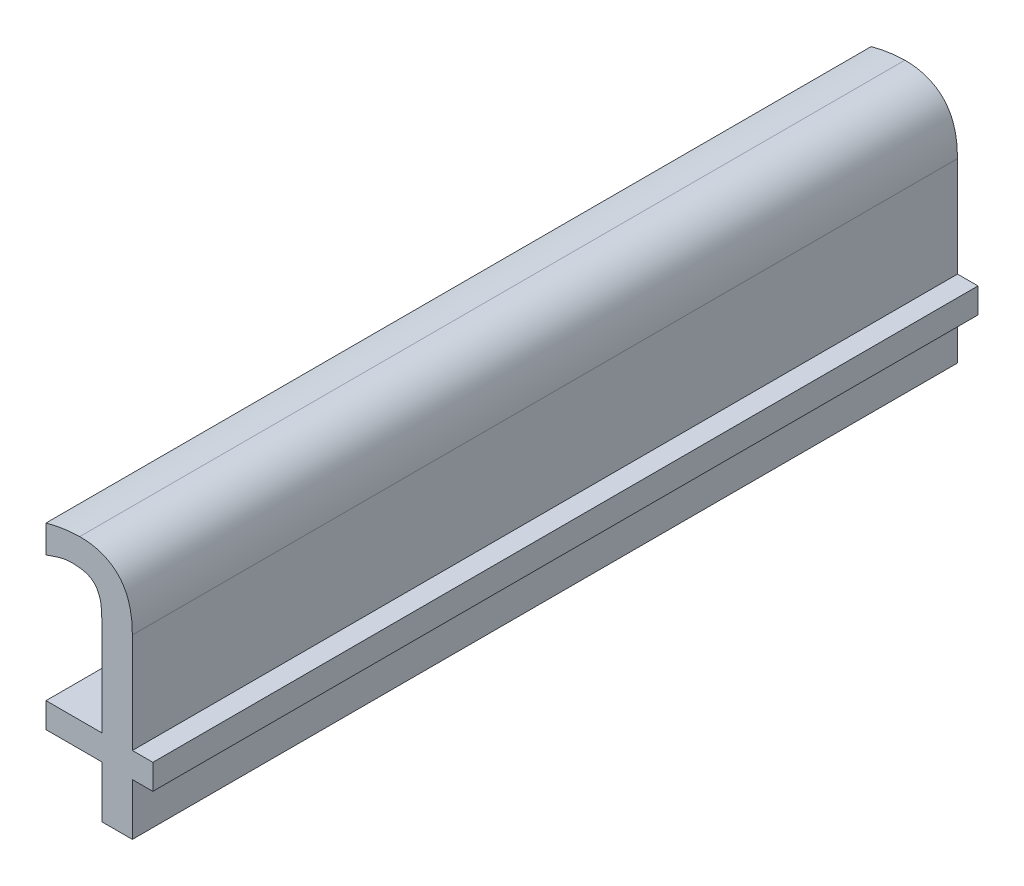
ISO-10303-21;
HEADER;
FILE_DESCRIPTION(('STEP AP214'),'2;1');
FILE_NAME('part.step','',(''),(''),'','','');
FILE_SCHEMA(('AUTOMOTIVE_DESIGN { 1 0 10303 214 1 1 1 1 }'));
ENDSEC;
DATA;
#1=APPLICATION_CONTEXT('core data for automotive mechanical design processes');
#2=APPLICATION_PROTOCOL_DEFINITION('international standard','automotive_design',2000,#1);
#3=PRODUCT_CONTEXT('',#1,'mechanical');
#4=PRODUCT('Part','Part','',(#3));
#5=PRODUCT_RELATED_PRODUCT_CATEGORY('part','',(#4));
#6=PRODUCT_DEFINITION_FORMATION('','',#4);
#7=PRODUCT_DEFINITION_CONTEXT('part definition',#1,'design');
#8=PRODUCT_DEFINITION('design','',#6,#7);
#9=PRODUCT_DEFINITION_SHAPE('','',#8);
#10=(LENGTH_UNIT() NAMED_UNIT(*) SI_UNIT(.MILLI.,.METRE.));
#11=(NAMED_UNIT(*) PLANE_ANGLE_UNIT() SI_UNIT($,.RADIAN.));
#12=(NAMED_UNIT(*) SI_UNIT($,.STERADIAN.) SOLID_ANGLE_UNIT());
#13=UNCERTAINTY_MEASURE_WITH_UNIT(LENGTH_MEASURE(1.E-05),#10,'distance_accuracy_value','');
#14=(GEOMETRIC_REPRESENTATION_CONTEXT(3) GLOBAL_UNCERTAINTY_ASSIGNED_CONTEXT((#13)) GLOBAL_UNIT_ASSIGNED_CONTEXT((#10,
#11,#12)) REPRESENTATION_CONTEXT('',''));
#15=CARTESIAN_POINT('',(0.,0.,0.));
#16=DIRECTION('',(0.,0.,1.));
#17=DIRECTION('',(1.,0.,0.));
#18=AXIS2_PLACEMENT_3D('',#15,#16,#17);
#19=CARTESIAN_POINT('',(4.99958278409742,3.57171991261153,0.));
#20=CARTESIAN_POINT('',(4.99958278409742,3.57171991261153,0.1));
#21=CARTESIAN_POINT('',(4.99976601556421,3.57180007637876,0.));
#22=CARTESIAN_POINT('',(4.99976601556421,3.57180007637876,0.1));
#23=CARTESIAN_POINT('',(4.999949247031,3.571880240146,0.));
#24=CARTESIAN_POINT('',(4.999949247031,3.571880240146,0.1));
#25=CARTESIAN_POINT('',(5.000327334592,3.572045653455,0.));
#26=CARTESIAN_POINT('',(5.000327334592,3.572045653455,0.1));
#27=CARTESIAN_POINT('',(5.002005098146,3.572589154324,0.));
#28=CARTESIAN_POINT('',(5.002005098146,3.572589154324,0.1));
#29=CARTESIAN_POINT('',(5.002903056105,3.572589154324,0.));
#30=CARTESIAN_POINT('',(5.002903056105,3.572589154324,0.1));
#31=B_SPLINE_SURFACE_WITH_KNOTS('',2,1,((#19,#20),(#21,#22),(#23,#24),(#25,#26),(#27,#28),(#29,
#30)),.UNSPECIFIED.,.F.,.F.,.F.,(3,2,1,3),(2,2),(-2.48462706973712,-2.,-1.,0.),(0.,0.01),.UNSPECIFIED.);
#32=CARTESIAN_POINT('',(4.99977074011654,3.57180214337042,0.1));
#33=CARTESIAN_POINT('',(5.00019724079842,3.57197394980934,0.1));
#34=CARTESIAN_POINT('',(5.00063255067664,3.57214782170769,0.1));
#35=CARTESIAN_POINT('',(5.00137153524604,3.57238152407649,0.1));
#36=CARTESIAN_POINT('',(5.00167007413485,3.57246003887722,0.1));
#37=CARTESIAN_POINT('',(5.00227859787437,3.57256779812837,0.1));
#38=CARTESIAN_POINT('',(5.00258867042853,3.57259651228609,0.1));
#39=CARTESIAN_POINT('',(5.002903056105,3.572589154324,0.1));
#40=B_SPLINE_CURVE_WITH_KNOTS('',3,(#32,#33,#34,#35,#36,#37,#38,#39),.UNSPECIFIED.,.F.,.F.,(4,2,
2,4),(0.,0.00139383914747323,0.00231744531135856,0.00325082728566496),.UNSPECIFIED.);
#41=CARTESIAN_POINT('',(4.99975365644677,3.57184119175821,0.1));
#42=VERTEX_POINT('',#41);
#43=CARTESIAN_POINT('',(5.002903056105,3.572589154324,0.1));
#44=VERTEX_POINT('',#43);
#45=EDGE_CURVE('E208',#42,#44,#40,.T.);
#46=DIRECTION('',(0.,0.,1.));
#47=VECTOR('',#46,1.);
#48=CARTESIAN_POINT('',(4.999736572777,3.57178719515928,0.));
#49=LINE('',#48,#47);
#50=CARTESIAN_POINT('',(4.99975365644677,3.57184119175821,0.));
#51=VERTEX_POINT('',#50);
#52=EDGE_CURVE('E146',#51,#42,#49,.T.);
#53=CARTESIAN_POINT('',(4.99977074011654,3.57180214337042,0.));
#54=CARTESIAN_POINT('',(5.00019724079843,3.57197394980934,0.));
#55=CARTESIAN_POINT('',(5.00063255067664,3.57214782170769,0.));
#56=CARTESIAN_POINT('',(5.00137153524605,3.57238152407649,0.));
#57=CARTESIAN_POINT('',(5.00167007413485,3.57246003887722,0.));
#58=CARTESIAN_POINT('',(5.00227859787438,3.57256779812837,0.));
#59=CARTESIAN_POINT('',(5.00258867042853,3.57259651228609,0.));
#60=CARTESIAN_POINT('',(5.002903056105,3.572589154324,0.));
#61=B_SPLINE_CURVE_WITH_KNOTS('',3,(#53,#54,#55,#56,#57,#58,#59,#60),.UNSPECIFIED.,.F.,.F.,(4,2,
2,4),(0.,0.00139383914747404,0.00231744531135842,0.00325082728566396),.UNSPECIFIED.);
#62=CARTESIAN_POINT('',(5.002903056105,3.572589154324,0.));
#63=VERTEX_POINT('',#62);
#64=EDGE_CURVE('E142',#51,#63,#61,.T.);
#65=DIRECTION('',(0.,0.,-1.));
#66=VECTOR('',#65,1.);
#67=CARTESIAN_POINT('',(5.002903056105,3.572589154324,0.05));
#68=LINE('',#67,#66);
#69=EDGE_CURVE('E143',#44,#63,#68,.T.);
#70=ORIENTED_EDGE('',*,*,#45,.F.);
#71=ORIENTED_EDGE('',*,*,#52,.F.);
#72=ORIENTED_EDGE('',*,*,#64,.T.);
#73=ORIENTED_EDGE('',*,*,#69,.F.);
#74=EDGE_LOOP('',(#70,#71,#72,#73));
#75=FACE_BOUND('',#74,.T.);
#76=ADVANCED_FACE('F17',(#75),#31,.T.);
#77=CARTESIAN_POINT('',(5.002903056105,3.572589154324,0.));
#78=CARTESIAN_POINT('',(5.002903056105,3.572589154324,0.1));
#79=CARTESIAN_POINT('',(5.004179101625,3.572589154324,0.));
#80=CARTESIAN_POINT('',(5.004179101625,3.572589154324,0.1));
#81=CARTESIAN_POINT('',(5.005667821398,3.571903870619,0.));
#82=CARTESIAN_POINT('',(5.005667821398,3.571903870619,0.1));
#83=CARTESIAN_POINT('',(5.005998648014,3.571218586914,0.));
#84=CARTESIAN_POINT('',(5.005998648014,3.571218586914,0.1));
#85=B_SPLINE_SURFACE_WITH_KNOTS('',2,1,((#77,#78),(#79,#80),(#81,#82),(#83,#84)),.UNSPECIFIED.,
.F.,.F.,.F.,(3,1,3),(2,2),(-2.,-1.,0.),(0.,0.01),.UNSPECIFIED.);
#86=CARTESIAN_POINT('',(5.002903056105,3.572589154324,0.1));
#87=CARTESIAN_POINT('',(5.0032338405436,3.57258669764765,0.1));
#88=CARTESIAN_POINT('',(5.00358269931623,3.57257162553546,0.1));
#89=CARTESIAN_POINT('',(5.00426705439678,3.57247347746843,0.1));
#90=CARTESIAN_POINT('',(5.00460261219088,3.57239076563957,0.1));
#91=CARTESIAN_POINT('',(5.00536060185048,3.57205022235926,0.1));
#92=CARTESIAN_POINT('',(5.00574884935335,3.57172797974789,0.1));
#93=CARTESIAN_POINT('',(5.00599864800042,3.57121858694212,0.1));
#94=B_SPLINE_CURVE_WITH_KNOTS('',3,(#86,#87,#88,#89,#90,#91,#92,#93),.UNSPECIFIED.,.F.,.F.,(4,2,
2,4),(0.,0.00102491313481117,0.00204434487850244,0.00354685890757763),.UNSPECIFIED.);
#95=CARTESIAN_POINT('',(5.005998648014,3.571218586914,0.1));
#96=VERTEX_POINT('',#95);
#97=EDGE_CURVE('E154',#44,#96,#94,.T.);
#98=CARTESIAN_POINT('',(5.002903056105,3.572589154324,0.));
#99=CARTESIAN_POINT('',(5.0032338405436,3.57258669764765,0.));
#100=CARTESIAN_POINT('',(5.00358269931623,3.57257162553546,0.));
#101=CARTESIAN_POINT('',(5.00426705439678,3.57247347746843,0.));
#102=CARTESIAN_POINT('',(5.00460261219088,3.57239076563957,0.));
#103=CARTESIAN_POINT('',(5.00536060185048,3.57205022235926,0.));
#104=CARTESIAN_POINT('',(5.00574884935335,3.57172797974789,0.));
#105=CARTESIAN_POINT('',(5.00599864800042,3.57121858694212,0.));
#106=B_SPLINE_CURVE_WITH_KNOTS('',3,(#98,#99,#100,#101,#102,#103,#104,#105),.UNSPECIFIED.,.F.,
.F.,(4,2,2,4),(0.,0.00102491313481117,0.00204434487850244,0.00354685890757912),.UNSPECIFIED.);
#107=CARTESIAN_POINT('',(5.00599864801486,3.57121858691456,0.));
#108=VERTEX_POINT('',#107);
#109=EDGE_CURVE('E137',#63,#108,#106,.T.);
#110=DIRECTION('',(0.,0.,-1.));
#111=VECTOR('',#110,1.);
#112=CARTESIAN_POINT('',(5.005998648014,3.571218586914,0.05));
#113=LINE('',#112,#111);
#114=EDGE_CURVE('E156',#96,#108,#113,.T.);
#115=ORIENTED_EDGE('',*,*,#97,.F.);
#116=ORIENTED_EDGE('',*,*,#69,.T.);
#117=ORIENTED_EDGE('',*,*,#109,.T.);
#118=ORIENTED_EDGE('',*,*,#114,.F.);
#119=EDGE_LOOP('',(#115,#116,#117,#118));
#120=FACE_BOUND('',#119,.T.);
#121=ADVANCED_FACE('F152',(#120),#85,.T.);
#122=CARTESIAN_POINT('',(5.005998648014,3.571218586914,0.));
#123=CARTESIAN_POINT('',(5.005998648014,3.571218586914,0.1));
#124=CARTESIAN_POINT('',(5.006400366048,3.570438781318,0.));
#125=CARTESIAN_POINT('',(5.006400366048,3.570438781318,0.1));
#126=CARTESIAN_POINT('',(5.006518518411,3.568619234929,0.));
#127=CARTESIAN_POINT('',(5.006518518411,3.568619234929,0.1));
#128=CARTESIAN_POINT('',(5.006518518411,3.566965101847,0.));
#129=CARTESIAN_POINT('',(5.006518518411,3.566965101847,0.1));
#130=B_SPLINE_SURFACE_WITH_KNOTS('',2,1,((#122,#123),(#124,#125),(#126,#127),(#128,#129)),
.UNSPECIFIED.,.F.,.F.,.F.,(3,1,3),(2,2),(-2.,-1.,0.),(0.,0.01),.UNSPECIFIED.);
#131=CARTESIAN_POINT('',(5.005998648014,3.571218586914,0.1));
#132=CARTESIAN_POINT('',(5.00617890398059,3.57090392574342,0.1));
#133=CARTESIAN_POINT('',(5.006289480242,3.57056949751319,0.1));
#134=CARTESIAN_POINT('',(5.00642999236957,3.5698816436223,0.1));
#135=CARTESIAN_POINT('',(5.00645991904458,3.56952821580104,0.1));
#136=CARTESIAN_POINT('',(5.0064978349018,3.56882301385988,0.1));
#137=CARTESIAN_POINT('',(5.00650582615831,3.56847123958675,0.1));
#138=CARTESIAN_POINT('',(5.0065143740803,3.56773506963006,0.1));
#139=CARTESIAN_POINT('',(5.00651417479553,3.56735066588093,0.1));
#140=CARTESIAN_POINT('',(5.006518518411,3.566965101847,0.1));
#141=B_SPLINE_CURVE_WITH_KNOTS('',3,(#131,#132,#133,#134,#135,#136,#137,#138,#139,#140),
.UNSPECIFIED.,.F.,.F.,(4,2,2,2,4),(0.,0.00105660986660643,0.00211334014378797,0.003169970489298,
0.00432432436821628),.UNSPECIFIED.);
#142=CARTESIAN_POINT('',(5.006518518411,3.566965101847,0.1));
#143=VERTEX_POINT('',#142);
#144=EDGE_CURVE('E207',#96,#143,#141,.T.);
#145=CARTESIAN_POINT('',(5.005998648014,3.571218586914,0.));
#146=CARTESIAN_POINT('',(5.00617890398059,3.57090392574342,0.));
#147=CARTESIAN_POINT('',(5.006289480242,3.57056949751319,0.));
#148=CARTESIAN_POINT('',(5.00642999236957,3.5698816436223,0.));
#149=CARTESIAN_POINT('',(5.00645991904458,3.56952821580104,0.));
#150=CARTESIAN_POINT('',(5.0064978349018,3.56882301385988,0.));
#151=CARTESIAN_POINT('',(5.00650582615831,3.56847123958675,0.));
#152=CARTESIAN_POINT('',(5.0065143740803,3.56773506963006,0.));
#153=CARTESIAN_POINT('',(5.00651417479553,3.56735066588093,0.));
#154=CARTESIAN_POINT('',(5.006518518411,3.566965101847,0.));
#155=B_SPLINE_CURVE_WITH_KNOTS('',3,(#145,#146,#147,#148,#149,#150,#151,#152,#153,#154),
.UNSPECIFIED.,.F.,.F.,(4,2,2,2,4),(0.,0.00105660986660643,0.00211334014378797,0.003169970489298,
0.00432432436821628),.UNSPECIFIED.);
#156=CARTESIAN_POINT('',(5.006518518411,3.566965101847,0.));
#157=VERTEX_POINT('',#156);
#158=EDGE_CURVE('E161',#108,#157,#155,.T.);
#159=DIRECTION('',(0.,0.,1.));
#160=VECTOR('',#159,1.);
#161=CARTESIAN_POINT('',(5.006518518411,3.566965101847,0.));
#162=LINE('',#161,#160);
#163=EDGE_CURVE('E346',#143,#157,#162,.F.);
#164=ORIENTED_EDGE('',*,*,#144,.F.);
#165=ORIENTED_EDGE('',*,*,#114,.T.);
#166=ORIENTED_EDGE('',*,*,#158,.T.);
#167=ORIENTED_EDGE('',*,*,#163,.F.);
#168=EDGE_LOOP('',(#164,#165,#166,#167));
#169=FACE_BOUND('',#168,.T.);
#170=ADVANCED_FACE('F186',(#169),#130,.T.);
#171=CARTESIAN_POINT('',(5.006518518411,3.566965101847,0.));
#172=DIRECTION('',(-1.,0.,0.));
#173=DIRECTION('',(0.,0.,1.));
#174=AXIS2_PLACEMENT_3D('',#171,#172,#173);
#175=PLANE('',#174);
#176=DIRECTION('',(0.,1.,0.));
#177=VECTOR('',#176,1.);
#178=CARTESIAN_POINT('',(5.006518518411,3.560627014666,0.1));
#179=LINE('',#178,#177);
#180=CARTESIAN_POINT('',(5.006518518411,3.556544063435,0.1));
#181=VERTEX_POINT('',#180);
#182=EDGE_CURVE('E341',#143,#181,#179,.F.);
#183=ORIENTED_EDGE('',*,*,#182,.F.);
#184=ORIENTED_EDGE('',*,*,#163,.T.);
#185=DIRECTION('',(0.,1.,0.));
#186=VECTOR('',#185,1.);
#187=CARTESIAN_POINT('',(5.006518518411,3.560627014666,0.));
#188=LINE('',#187,#186);
#189=CARTESIAN_POINT('',(5.006518518411,3.556544063435,0.));
#190=VERTEX_POINT('',#189);
#191=EDGE_CURVE('E163',#157,#190,#188,.F.);
#192=ORIENTED_EDGE('',*,*,#191,.T.);
#193=DIRECTION('',(0.,0.,1.));
#194=VECTOR('',#193,1.);
#195=CARTESIAN_POINT('',(5.006518518411,3.556544063435,0.));
#196=LINE('',#195,#194);
#197=EDGE_CURVE('E336',#181,#190,#196,.F.);
#198=ORIENTED_EDGE('',*,*,#197,.F.);
#199=EDGE_LOOP('',(#183,#184,#192,#198));
#200=FACE_BOUND('',#199,.T.);
#201=ADVANCED_FACE('F390',(#200),#175,.T.);
#202=CARTESIAN_POINT('',(5.006518518411,3.556544063435,0.));
#203=DIRECTION('',(0.,1.,0.));
#204=DIRECTION('',(0.,0.,1.));
#205=AXIS2_PLACEMENT_3D('',#202,#203,#204);
#206=PLANE('',#205);
#207=DIRECTION('',(1.,0.,0.));
#208=VECTOR('',#207,1.);
#209=CARTESIAN_POINT('',(5.006616061911,3.556544063435,0.1));
#210=LINE('',#209,#208);
#211=CARTESIAN_POINT('',(4.999736572777,3.556544063435,0.1));
#212=VERTEX_POINT('',#211);
#213=EDGE_CURVE('E331',#181,#212,#210,.F.);
#214=ORIENTED_EDGE('',*,*,#213,.F.);
#215=ORIENTED_EDGE('',*,*,#197,.T.);
#216=DIRECTION('',(1.,0.,0.));
#217=VECTOR('',#216,1.);
#218=CARTESIAN_POINT('',(5.006616061911,3.556544063435,0.));
#219=LINE('',#218,#217);
#220=CARTESIAN_POINT('',(4.999736572777,3.556544063435,0.));
#221=VERTEX_POINT('',#220);
#222=EDGE_CURVE('E381',#190,#221,#219,.F.);
#223=ORIENTED_EDGE('',*,*,#222,.T.);
#224=DIRECTION('',(0.,0.,1.));
#225=VECTOR('',#224,1.);
#226=CARTESIAN_POINT('',(4.999736572777,3.556544063435,0.));
#227=LINE('',#226,#225);
#228=EDGE_CURVE('E326',#212,#221,#227,.F.);
#229=ORIENTED_EDGE('',*,*,#228,.F.);
#230=EDGE_LOOP('',(#214,#215,#223,#229));
#231=FACE_BOUND('',#230,.T.);
#232=ADVANCED_FACE('F394',(#231),#206,.T.);
#233=CARTESIAN_POINT('',(4.999736572777,3.556544063435,0.));
#234=DIRECTION('',(-1.,0.,0.));
#235=DIRECTION('',(0.,0.,1.));
#236=AXIS2_PLACEMENT_3D('',#233,#234,#235);
#237=PLANE('',#236);
#238=DIRECTION('',(0.,1.,0.));
#239=VECTOR('',#238,1.);
#240=CARTESIAN_POINT('',(4.999736572777,3.560627014666,0.1));
#241=LINE('',#240,#239);
#242=CARTESIAN_POINT('',(4.999736572777,3.55349573247,0.1));
#243=VERTEX_POINT('',#242);
#244=EDGE_CURVE('E321',#212,#243,#241,.F.);
#245=ORIENTED_EDGE('',*,*,#244,.F.);
#246=ORIENTED_EDGE('',*,*,#228,.T.);
#247=DIRECTION('',(0.,1.,0.));
#248=VECTOR('',#247,1.);
#249=CARTESIAN_POINT('',(4.999736572777,3.560627014666,0.));
#250=LINE('',#249,#248);
#251=CARTESIAN_POINT('',(4.999736572777,3.55349573247,0.));
#252=VERTEX_POINT('',#251);
#253=EDGE_CURVE('E377',#221,#252,#250,.F.);
#254=ORIENTED_EDGE('',*,*,#253,.T.);
#255=DIRECTION('',(0.,0.,-1.));
#256=VECTOR('',#255,1.);
#257=CARTESIAN_POINT('',(4.999736572777,3.55349573247,0.));
#258=LINE('',#257,#256);
#259=EDGE_CURVE('E316',#243,#252,#258,.T.);
#260=ORIENTED_EDGE('',*,*,#259,.F.);
#261=EDGE_LOOP('',(#245,#246,#254,#260));
#262=FACE_BOUND('',#261,.T.);
#263=ADVANCED_FACE('F400',(#262),#237,.T.);
#264=CARTESIAN_POINT('',(4.999736572777,3.55349573247,0.));
#265=DIRECTION('',(0.,-1.,0.));
#266=DIRECTION('',(0.,0.,-1.));
#267=AXIS2_PLACEMENT_3D('',#264,#265,#266);
#268=PLANE('',#267);
#269=DIRECTION('',(1.,0.,0.));
#270=VECTOR('',#269,1.);
#271=CARTESIAN_POINT('',(5.006616061911,3.55349573247,0.1));
#272=LINE('',#271,#270);
#273=CARTESIAN_POINT('',(5.006518518411,3.55349573247,0.1));
#274=VERTEX_POINT('',#273);
#275=EDGE_CURVE('E311',#243,#274,#272,.T.);
#276=ORIENTED_EDGE('',*,*,#275,.F.);
#277=ORIENTED_EDGE('',*,*,#259,.T.);
#278=DIRECTION('',(1.,0.,0.));
#279=VECTOR('',#278,1.);
#280=CARTESIAN_POINT('',(5.006616061911,3.55349573247,0.));
#281=LINE('',#280,#279);
#282=CARTESIAN_POINT('',(5.006518518411,3.55349573247,0.));
#283=VERTEX_POINT('',#282);
#284=EDGE_CURVE('E373',#252,#283,#281,.T.);
#285=ORIENTED_EDGE('',*,*,#284,.T.);
#286=DIRECTION('',(0.,0.,1.));
#287=VECTOR('',#286,1.);
#288=CARTESIAN_POINT('',(5.006518518411,3.55349573247,0.));
#289=LINE('',#288,#287);
#290=EDGE_CURVE('E306',#274,#283,#289,.F.);
#291=ORIENTED_EDGE('',*,*,#290,.F.);
#292=EDGE_LOOP('',(#276,#277,#285,#291));
#293=FACE_BOUND('',#292,.T.);
#294=ADVANCED_FACE('F403',(#293),#268,.T.);
#295=CARTESIAN_POINT('',(5.006518518411,3.55349573247,0.));
#296=DIRECTION('',(-1.,0.,0.));
#297=DIRECTION('',(0.,0.,1.));
#298=AXIS2_PLACEMENT_3D('',#295,#296,#297);
#299=PLANE('',#298);
#300=DIRECTION('',(0.,1.,0.));
#301=VECTOR('',#300,1.);
#302=CARTESIAN_POINT('',(5.006518518411,3.560627014666,0.1));
#303=LINE('',#302,#301);
#304=CARTESIAN_POINT('',(5.006518518411,3.547210026761,0.1));
#305=VERTEX_POINT('',#304);
#306=EDGE_CURVE('E301',#274,#305,#303,.F.);
#307=ORIENTED_EDGE('',*,*,#306,.F.);
#308=ORIENTED_EDGE('',*,*,#290,.T.);
#309=DIRECTION('',(0.,1.,0.));
#310=VECTOR('',#309,1.);
#311=CARTESIAN_POINT('',(5.006518518411,3.560627014666,0.));
#312=LINE('',#311,#310);
#313=CARTESIAN_POINT('',(5.006518518411,3.547210026761,0.));
#314=VERTEX_POINT('',#313);
#315=EDGE_CURVE('E369',#283,#314,#312,.F.);
#316=ORIENTED_EDGE('',*,*,#315,.T.);
#317=DIRECTION('',(0.,0.,-1.));
#318=VECTOR('',#317,1.);
#319=CARTESIAN_POINT('',(5.006518518411,3.547210026761,0.));
#320=LINE('',#319,#318);
#321=EDGE_CURVE('E296',#305,#314,#320,.T.);
#322=ORIENTED_EDGE('',*,*,#321,.F.);
#323=EDGE_LOOP('',(#307,#308,#316,#322));
#324=FACE_BOUND('',#323,.T.);
#325=ADVANCED_FACE('F476',(#324),#299,.T.);
#326=CARTESIAN_POINT('',(5.006518518411,3.547210026761,0.));
#327=DIRECTION('',(0.,-1.,0.));
#328=DIRECTION('',(0.,0.,-1.));
#329=AXIS2_PLACEMENT_3D('',#326,#327,#328);
#330=PLANE('',#329);
#331=DIRECTION('',(1.,0.,0.));
#332=VECTOR('',#331,1.);
#333=CARTESIAN_POINT('',(5.006616061911,3.547210026761,0.1));
#334=LINE('',#333,#332);
#335=CARTESIAN_POINT('',(5.010204872135,3.547210026761,0.1));
#336=VERTEX_POINT('',#335);
#337=EDGE_CURVE('E291',#305,#336,#334,.T.);
#338=ORIENTED_EDGE('',*,*,#337,.F.);
#339=ORIENTED_EDGE('',*,*,#321,.T.);
#340=DIRECTION('',(1.,0.,0.));
#341=VECTOR('',#340,1.);
#342=CARTESIAN_POINT('',(5.006616061911,3.547210026761,0.));
#343=LINE('',#342,#341);
#344=CARTESIAN_POINT('',(5.010204872135,3.547210026761,0.));
#345=VERTEX_POINT('',#344);
#346=EDGE_CURVE('E365',#314,#345,#343,.T.);
#347=ORIENTED_EDGE('',*,*,#346,.T.);
#348=DIRECTION('',(0.,0.,-1.));
#349=VECTOR('',#348,1.);
#350=CARTESIAN_POINT('',(5.010204872135,3.547210026761,0.));
#351=LINE('',#350,#349);
#352=EDGE_CURVE('E286',#336,#345,#351,.T.);
#353=ORIENTED_EDGE('',*,*,#352,.F.);
#354=EDGE_LOOP('',(#338,#339,#347,#353));
#355=FACE_BOUND('',#354,.T.);
#356=ADVANCED_FACE('F472',(#355),#330,.T.);
#357=CARTESIAN_POINT('',(5.010204872135,3.547210026761,0.));
#358=DIRECTION('',(1.,0.,0.));
#359=DIRECTION('',(0.,0.,-1.));
#360=AXIS2_PLACEMENT_3D('',#357,#358,#359);
#361=PLANE('',#360);
#362=DIRECTION('',(0.,1.,0.));
#363=VECTOR('',#362,1.);
#364=CARTESIAN_POINT('',(5.010204872135,3.560627014666,0.1));
#365=LINE('',#364,#363);
#366=CARTESIAN_POINT('',(5.010204872135,3.55349573247,0.1));
#367=VERTEX_POINT('',#366);
#368=EDGE_CURVE('E246',#336,#367,#365,.T.);
#369=ORIENTED_EDGE('',*,*,#368,.F.);
#370=ORIENTED_EDGE('',*,*,#352,.T.);
#371=DIRECTION('',(0.,1.,0.));
#372=VECTOR('',#371,1.);
#373=CARTESIAN_POINT('',(5.010204872135,3.560627014666,0.));
#374=LINE('',#373,#372);
#375=CARTESIAN_POINT('',(5.010204872135,3.55349573247,0.));
#376=VERTEX_POINT('',#375);
#377=EDGE_CURVE('E361',#345,#376,#374,.T.);
#378=ORIENTED_EDGE('',*,*,#377,.T.);
#379=DIRECTION('',(0.,0.,-1.));
#380=VECTOR('',#379,1.);
#381=CARTESIAN_POINT('',(5.010204872135,3.55349573247,0.));
#382=LINE('',#381,#380);
#383=EDGE_CURVE('E283',#367,#376,#382,.T.);
#384=ORIENTED_EDGE('',*,*,#383,.F.);
#385=EDGE_LOOP('',(#369,#370,#378,#384));
#386=FACE_BOUND('',#385,.T.);
#387=ADVANCED_FACE('F468',(#386),#361,.T.);
#388=CARTESIAN_POINT('',(5.010204872135,3.55349573247,0.));
#389=DIRECTION('',(0.,-1.,0.));
#390=DIRECTION('',(0.,0.,-1.));
#391=AXIS2_PLACEMENT_3D('',#388,#389,#390);
#392=PLANE('',#391);
#393=DIRECTION('',(1.,0.,0.));
#394=VECTOR('',#393,1.);
#395=CARTESIAN_POINT('',(5.006616061911,3.55349573247,0.1));
#396=LINE('',#395,#394);
#397=CARTESIAN_POINT('',(5.012686071758,3.55349573247,0.1));
#398=VERTEX_POINT('',#397);
#399=EDGE_CURVE('E241',#367,#398,#396,.T.);
#400=ORIENTED_EDGE('',*,*,#399,.F.);
#401=ORIENTED_EDGE('',*,*,#383,.T.);
#402=DIRECTION('',(1.,0.,0.));
#403=VECTOR('',#402,1.);
#404=CARTESIAN_POINT('',(5.006616061911,3.55349573247,0.));
#405=LINE('',#404,#403);
#406=CARTESIAN_POINT('',(5.012686071758,3.55349573247,0.));
#407=VERTEX_POINT('',#406);
#408=EDGE_CURVE('E263',#376,#407,#405,.T.);
#409=ORIENTED_EDGE('',*,*,#408,.T.);
#410=DIRECTION('',(0.,0.,-1.));
#411=VECTOR('',#410,1.);
#412=CARTESIAN_POINT('',(5.012686071758,3.55349573247,0.));
#413=LINE('',#412,#411);
#414=EDGE_CURVE('E150',#398,#407,#413,.T.);
#415=ORIENTED_EDGE('',*,*,#414,.F.);
#416=EDGE_LOOP('',(#400,#401,#409,#415));
#417=FACE_BOUND('',#416,.T.);
#418=ADVANCED_FACE('F464',(#417),#392,.T.);
#419=CARTESIAN_POINT('',(5.003824644536,3.575802898597,0.));
#420=CARTESIAN_POINT('',(5.003824644536,3.575802898597,0.1));
#421=CARTESIAN_POINT('',(5.002903056105,3.575802898597,0.));
#422=CARTESIAN_POINT('',(5.002903056105,3.575802898597,0.1));
#423=CARTESIAN_POINT('',(5.000776313571,3.57547207198,0.));
#424=CARTESIAN_POINT('',(5.000776313571,3.57547207198,0.1));
#425=CARTESIAN_POINT('',(4.999736572777,3.575188506309,0.));
#426=CARTESIAN_POINT('',(4.999736572777,3.575188506309,0.1));
#427=B_SPLINE_SURFACE_WITH_KNOTS('',2,1,((#419,#420),(#421,#422),(#423,#424),(#425,#426)),
.UNSPECIFIED.,.F.,.F.,.F.,(3,1,3),(2,2),(-2.,-1.,0.),(0.,0.01),.UNSPECIFIED.);
#428=CARTESIAN_POINT('',(5.003824644536,3.575802898597,0.1));
#429=CARTESIAN_POINT('',(5.00346480325134,3.57580223160319,0.1));
#430=CARTESIAN_POINT('',(5.00310583500109,3.57578391178233,0.1));
#431=CARTESIAN_POINT('',(5.00239049245941,3.57571816804103,0.1));
#432=CARTESIAN_POINT('',(5.00203411815203,3.57567074429972,0.1));
#433=CARTESIAN_POINT('',(5.00102509634534,3.57550324024044,0.1));
#434=CARTESIAN_POINT('',(5.00037658111743,3.57535562741412,0.1));
#435=CARTESIAN_POINT('',(4.999736572777,3.575188506309,0.1));
#436=B_SPLINE_CURVE_WITH_KNOTS('',3,(#428,#429,#430,#431,#432,#433,#434,#435),.UNSPECIFIED.,.F.,
.F.,(4,2,2,4),(0.,0.00107773031356028,0.00215545399359062,0.00414393501889258),.UNSPECIFIED.);
#437=CARTESIAN_POINT('',(5.003824644536,3.575802898597,0.1));
#438=VERTEX_POINT('',#437);
#439=CARTESIAN_POINT('',(4.999736572777,3.575188506309,0.1));
#440=VERTEX_POINT('',#439);
#441=EDGE_CURVE('E224',#438,#440,#436,.T.);
#442=DIRECTION('',(0.,0.,1.));
#443=VECTOR('',#442,1.);
#444=CARTESIAN_POINT('',(5.003824644536,3.575802898597,0.05));
#445=LINE('',#444,#443);
#446=CARTESIAN_POINT('',(5.003824644536,3.575802898597,0.));
#447=VERTEX_POINT('',#446);
#448=EDGE_CURVE('E274',#447,#438,#445,.T.);
#449=CARTESIAN_POINT('',(5.003824644536,3.575802898597,0.));
#450=CARTESIAN_POINT('',(5.00346480325134,3.57580223160319,0.));
#451=CARTESIAN_POINT('',(5.00310583500109,3.57578391178233,0.));
#452=CARTESIAN_POINT('',(5.00239049245941,3.57571816804103,0.));
#453=CARTESIAN_POINT('',(5.00203411815203,3.57567074429972,0.));
#454=CARTESIAN_POINT('',(5.00102509634534,3.57550324024044,0.));
#455=CARTESIAN_POINT('',(5.00037658111743,3.57535562741412,0.));
#456=CARTESIAN_POINT('',(4.999736572777,3.575188506309,0.));
#457=B_SPLINE_CURVE_WITH_KNOTS('',3,(#449,#450,#451,#452,#453,#454,#455,#456),.UNSPECIFIED.,.F.,
.F.,(4,2,2,4),(0.,0.00107773031356028,0.00215545399359062,0.00414393501889258),.UNSPECIFIED.);
#458=CARTESIAN_POINT('',(4.999736572777,3.575188506309,0.));
#459=VERTEX_POINT('',#458);
#460=EDGE_CURVE('E262',#447,#459,#457,.T.);
#461=DIRECTION('',(0.,0.,1.));
#462=VECTOR('',#461,1.);
#463=CARTESIAN_POINT('',(4.999736572777,3.575188506309,0.));
#464=LINE('',#463,#462);
#465=EDGE_CURVE('E271',#440,#459,#464,.F.);
#466=ORIENTED_EDGE('',*,*,#441,.F.);
#467=ORIENTED_EDGE('',*,*,#448,.F.);
#468=ORIENTED_EDGE('',*,*,#460,.T.);
#469=ORIENTED_EDGE('',*,*,#465,.F.);
#470=EDGE_LOOP('',(#466,#467,#468,#469));
#471=FACE_BOUND('',#470,.T.);
#472=ADVANCED_FACE('F447',(#471),#427,.T.);
#473=CARTESIAN_POINT('',(4.999736572777,3.575188506309,0.));
#474=DIRECTION('',(-1.,0.,0.));
#475=DIRECTION('',(0.,0.,1.));
#476=AXIS2_PLACEMENT_3D('',#473,#474,#475);
#477=PLANE('',#476);
#478=DIRECTION('',(0.,1.,0.));
#479=VECTOR('',#478,1.);
#480=CARTESIAN_POINT('',(4.999736572777,3.560627014666,0.1));
#481=LINE('',#480,#479);
#482=EDGE_CURVE('E240',#440,#42,#481,.F.);
#483=ORIENTED_EDGE('',*,*,#482,.F.);
#484=ORIENTED_EDGE('',*,*,#465,.T.);
#485=DIRECTION('',(0.,1.,0.));
#486=VECTOR('',#485,1.);
#487=CARTESIAN_POINT('',(4.999736572777,3.560627014666,0.));
#488=LINE('',#487,#486);
#489=EDGE_CURVE('E356',#459,#51,#488,.F.);
#490=ORIENTED_EDGE('',*,*,#489,.T.);
#491=ORIENTED_EDGE('',*,*,#52,.T.);
#492=EDGE_LOOP('',(#483,#484,#490,#491));
#493=FACE_BOUND('',#492,.T.);
#494=ADVANCED_FACE('F450',(#493),#477,.T.);
#495=CARTESIAN_POINT('',(5.012686071758,3.55349573247,0.));
#496=DIRECTION('',(1.,0.,0.));
#497=DIRECTION('',(0.,0.,-1.));
#498=AXIS2_PLACEMENT_3D('',#495,#496,#497);
#499=PLANE('',#498);
#500=DIRECTION('',(0.,1.,0.));
#501=VECTOR('',#500,1.);
#502=CARTESIAN_POINT('',(5.012686071758,3.560627014666,0.1));
#503=LINE('',#502,#501);
#504=CARTESIAN_POINT('',(5.012686071758,3.556544063435,0.1));
#505=VERTEX_POINT('',#504);
#506=EDGE_CURVE('E238',#398,#505,#503,.T.);
#507=ORIENTED_EDGE('',*,*,#506,.F.);
#508=ORIENTED_EDGE('',*,*,#414,.T.);
#509=DIRECTION('',(0.,1.,0.));
#510=VECTOR('',#509,1.);
#511=CARTESIAN_POINT('',(5.012686071758,3.560627014666,0.));
#512=LINE('',#511,#510);
#513=CARTESIAN_POINT('',(5.012686071758,3.556544063435,0.));
#514=VERTEX_POINT('',#513);
#515=EDGE_CURVE('E260',#407,#514,#512,.T.);
#516=ORIENTED_EDGE('',*,*,#515,.T.);
#517=DIRECTION('',(0.,0.,1.));
#518=VECTOR('',#517,1.);
#519=CARTESIAN_POINT('',(5.012686071758,3.556544063435,0.));
#520=LINE('',#519,#518);
#521=EDGE_CURVE('E254',#505,#514,#520,.F.);
#522=ORIENTED_EDGE('',*,*,#521,.F.);
#523=EDGE_LOOP('',(#507,#508,#516,#522));
#524=FACE_BOUND('',#523,.T.);
#525=ADVANCED_FACE('F457',(#524),#499,.T.);
#526=CARTESIAN_POINT('',(5.006616061911,3.560627014666,0.));
#527=DIRECTION('',(0.,0.,1.));
#528=DIRECTION('',(1.,0.,0.));
#529=AXIS2_PLACEMENT_3D('',#526,#527,#528);
#530=PLANE('',#529);
#531=ORIENTED_EDGE('',*,*,#460,.F.);
#532=CARTESIAN_POINT('',(5.010204872135,3.568666495874,0.));
#533=CARTESIAN_POINT('',(5.01020386197775,3.56920373725188,0.));
#534=CARTESIAN_POINT('',(5.01017849859557,3.56974483556876,0.));
#535=CARTESIAN_POINT('',(5.01006487387159,3.57068742367832,0.));
#536=CARTESIAN_POINT('',(5.00999323358609,3.57109114849644,0.));
#537=CARTESIAN_POINT('',(5.00979840728135,3.57185821855956,0.));
#538=CARTESIAN_POINT('',(5.009678955051,3.5722224660196,0.));
#539=CARTESIAN_POINT('',(5.00928130397374,3.57311971664916,0.));
#540=CARTESIAN_POINT('',(5.0089516381801,3.57363271444296,0.));
#541=CARTESIAN_POINT('',(5.00815279218088,3.57447048089167,0.));
#542=CARTESIAN_POINT('',(5.00769436608199,3.57480551030182,0.));
#543=CARTESIAN_POINT('',(5.00689728244424,3.57522295497192,0.));
#544=CARTESIAN_POINT('',(5.00658110590822,3.57535294977143,0.));
#545=CARTESIAN_POINT('',(5.00547530976605,3.57570774869174,0.));
#546=CARTESIAN_POINT('',(5.00464345484793,3.57580992192586,0.));
#547=CARTESIAN_POINT('',(5.003824644536,3.575802898597,0.));
#548=B_SPLINE_CURVE_WITH_KNOTS('',3,(#532,#533,#534,#535,#536,#537,#538,#539,#540,#541,#542,
#543,#544,#545,#546,#547),.UNSPECIFIED.,.F.,.F.,(4,2,2,2,2,2,2,4),(0.,0.00161672416237656,
0.00284404340744965,0.00398996327533995,0.00577893997522516,0.00744876893056778,
0.0084711438843806,0.0109270221695582),.UNSPECIFIED.);
#549=CARTESIAN_POINT('',(5.010204872135,3.568666495874,0.));
#550=VERTEX_POINT('',#549);
#551=EDGE_CURVE('E276',#550,#447,#548,.T.);
#552=ORIENTED_EDGE('',*,*,#551,.F.);
#553=DIRECTION('',(0.,1.,0.));
#554=VECTOR('',#553,1.);
#555=CARTESIAN_POINT('',(5.010204872135,3.556544063435,0.));
#556=LINE('',#555,#554);
#557=CARTESIAN_POINT('',(5.010204872135,3.556544063435,0.));
#558=VERTEX_POINT('',#557);
#559=EDGE_CURVE('E257',#558,#550,#556,.T.);
#560=ORIENTED_EDGE('',*,*,#559,.F.);
#561=DIRECTION('',(1.,0.,0.));
#562=VECTOR('',#561,1.);
#563=CARTESIAN_POINT('',(5.012686071758,3.556544063435,0.));
#564=LINE('',#563,#562);
#565=EDGE_CURVE('E268',#514,#558,#564,.F.);
#566=ORIENTED_EDGE('',*,*,#565,.F.);
#567=ORIENTED_EDGE('',*,*,#515,.F.);
#568=ORIENTED_EDGE('',*,*,#408,.F.);
#569=ORIENTED_EDGE('',*,*,#377,.F.);
#570=ORIENTED_EDGE('',*,*,#346,.F.);
#571=ORIENTED_EDGE('',*,*,#315,.F.);
#572=ORIENTED_EDGE('',*,*,#284,.F.);
#573=ORIENTED_EDGE('',*,*,#253,.F.);
#574=ORIENTED_EDGE('',*,*,#222,.F.);
#575=ORIENTED_EDGE('',*,*,#191,.F.);
#576=ORIENTED_EDGE('',*,*,#158,.F.);
#577=ORIENTED_EDGE('',*,*,#109,.F.);
#578=ORIENTED_EDGE('',*,*,#64,.F.);
#579=ORIENTED_EDGE('',*,*,#489,.F.);
#580=EDGE_LOOP('',(#531,#552,#560,#566,#567,#568,#569,#570,#571,#572,#573,#574,#575,#576,#577,
#578,#579));
#581=FACE_BOUND('',#580,.T.);
#582=ADVANCED_FACE('F159',(#581),#530,.F.);
#583=CARTESIAN_POINT('',(5.010204872135,3.568666495874,0.));
#584=CARTESIAN_POINT('',(5.010204872135,3.568666495874,0.1));
#585=CARTESIAN_POINT('',(5.010204872135,3.572376480071,0.));
#586=CARTESIAN_POINT('',(5.010204872135,3.572376480071,0.1));
#587=CARTESIAN_POINT('',(5.006825714555,3.575802898597,0.));
#588=CARTESIAN_POINT('',(5.006825714555,3.575802898597,0.1));
#589=CARTESIAN_POINT('',(5.003824644536,3.575802898597,0.));
#590=CARTESIAN_POINT('',(5.003824644536,3.575802898597,0.1));
#591=B_SPLINE_SURFACE_WITH_KNOTS('',2,1,((#583,#584),(#585,#586),(#587,#588),(#589,#590)),
.UNSPECIFIED.,.F.,.F.,.F.,(3,1,3),(2,2),(-2.,-1.,0.),(0.,0.01),.UNSPECIFIED.);
#592=CARTESIAN_POINT('',(5.010204872135,3.568666495874,0.1));
#593=CARTESIAN_POINT('',(5.01020386197775,3.56920373725188,0.1));
#594=CARTESIAN_POINT('',(5.01017849859557,3.56974483556876,0.1));
#595=CARTESIAN_POINT('',(5.01006487387159,3.57068742367832,0.1));
#596=CARTESIAN_POINT('',(5.00999323358609,3.57109114849644,0.1));
#597=CARTESIAN_POINT('',(5.00979840728135,3.57185821855956,0.1));
#598=CARTESIAN_POINT('',(5.009678955051,3.5722224660196,0.1));
#599=CARTESIAN_POINT('',(5.00928130397374,3.57311971664916,0.1));
#600=CARTESIAN_POINT('',(5.0089516381801,3.57363271444296,0.1));
#601=CARTESIAN_POINT('',(5.00815279218088,3.57447048089167,0.1));
#602=CARTESIAN_POINT('',(5.00769436608199,3.57480551030182,0.1));
#603=CARTESIAN_POINT('',(5.00689728244424,3.57522295497192,0.1));
#604=CARTESIAN_POINT('',(5.00658110590822,3.57535294977143,0.1));
#605=CARTESIAN_POINT('',(5.00547530976605,3.57570774869174,0.1));
#606=CARTESIAN_POINT('',(5.00464345484793,3.57580992192586,0.1));
#607=CARTESIAN_POINT('',(5.003824644536,3.575802898597,0.1));
#608=B_SPLINE_CURVE_WITH_KNOTS('',3,(#592,#593,#594,#595,#596,#597,#598,#599,#600,#601,#602,
#603,#604,#605,#606,#607),.UNSPECIFIED.,.F.,.F.,(4,2,2,2,2,2,2,4),(0.,0.00161672416237656,
0.00284404340744965,0.00398996327533995,0.00577893997522516,0.00744876893056943,
0.00847114388438048,0.0109270221695581),.UNSPECIFIED.);
#609=CARTESIAN_POINT('',(5.010204872135,3.568666495874,0.1));
#610=VERTEX_POINT('',#609);
#611=EDGE_CURVE('E232',#610,#438,#608,.T.);
#612=DIRECTION('',(0.,0.,-1.));
#613=VECTOR('',#612,1.);
#614=CARTESIAN_POINT('',(5.010204872135,3.568666495874,0.));
#615=LINE('',#614,#613);
#616=EDGE_CURVE('E424',#550,#610,#615,.F.);
#617=ORIENTED_EDGE('',*,*,#611,.F.);
#618=ORIENTED_EDGE('',*,*,#616,.F.);
#619=ORIENTED_EDGE('',*,*,#551,.T.);
#620=ORIENTED_EDGE('',*,*,#448,.T.);
#621=EDGE_LOOP('',(#617,#618,#619,#620));
#622=FACE_BOUND('',#621,.T.);
#623=ADVANCED_FACE('F19',(#622),#591,.T.);
#624=CARTESIAN_POINT('',(5.006616061911,3.560627014666,0.1));
#625=DIRECTION('',(0.,0.,1.));
#626=DIRECTION('',(1.,0.,0.));
#627=AXIS2_PLACEMENT_3D('',#624,#625,#626);
#628=PLANE('',#627);
#629=ORIENTED_EDGE('',*,*,#441,.T.);
#630=ORIENTED_EDGE('',*,*,#482,.T.);
#631=ORIENTED_EDGE('',*,*,#45,.T.);
#632=ORIENTED_EDGE('',*,*,#97,.T.);
#633=ORIENTED_EDGE('',*,*,#144,.T.);
#634=ORIENTED_EDGE('',*,*,#182,.T.);
#635=ORIENTED_EDGE('',*,*,#213,.T.);
#636=ORIENTED_EDGE('',*,*,#244,.T.);
#637=ORIENTED_EDGE('',*,*,#275,.T.);
#638=ORIENTED_EDGE('',*,*,#306,.T.);
#639=ORIENTED_EDGE('',*,*,#337,.T.);
#640=ORIENTED_EDGE('',*,*,#368,.T.);
#641=ORIENTED_EDGE('',*,*,#399,.T.);
#642=ORIENTED_EDGE('',*,*,#506,.T.);
#643=DIRECTION('',(1.,0.,0.));
#644=VECTOR('',#643,1.);
#645=CARTESIAN_POINT('',(5.012686071758,3.556544063435,0.1));
#646=LINE('',#645,#644);
#647=CARTESIAN_POINT('',(5.010204872135,3.556544063435,0.1));
#648=VERTEX_POINT('',#647);
#649=EDGE_CURVE('E39',#648,#505,#646,.T.);
#650=ORIENTED_EDGE('',*,*,#649,.F.);
#651=DIRECTION('',(0.,1.,0.));
#652=VECTOR('',#651,1.);
#653=CARTESIAN_POINT('',(5.010204872135,3.556544063435,0.1));
#654=LINE('',#653,#652);
#655=EDGE_CURVE('E30',#610,#648,#654,.F.);
#656=ORIENTED_EDGE('',*,*,#655,.F.);
#657=ORIENTED_EDGE('',*,*,#611,.T.);
#658=EDGE_LOOP('',(#629,#630,#631,#632,#633,#634,#635,#636,#637,#638,#639,#640,#641,#642,#650,
#656,#657));
#659=FACE_BOUND('',#658,.T.);
#660=ADVANCED_FACE('F215',(#659),#628,.T.);
#661=CARTESIAN_POINT('',(5.012686071758,3.556544063435,0.));
#662=DIRECTION('',(0.,1.,0.));
#663=DIRECTION('',(0.,0.,1.));
#664=AXIS2_PLACEMENT_3D('',#661,#662,#663);
#665=PLANE('',#664);
#666=ORIENTED_EDGE('',*,*,#649,.T.);
#667=ORIENTED_EDGE('',*,*,#521,.T.);
#668=ORIENTED_EDGE('',*,*,#565,.T.);
#669=DIRECTION('',(0.,0.,-1.));
#670=VECTOR('',#669,1.);
#671=CARTESIAN_POINT('',(5.010204872135,3.556544063435,0.));
#672=LINE('',#671,#670);
#673=EDGE_CURVE('E11',#648,#558,#672,.T.);
#674=ORIENTED_EDGE('',*,*,#673,.F.);
#675=EDGE_LOOP('',(#666,#667,#668,#674));
#676=FACE_BOUND('',#675,.T.);
#677=ADVANCED_FACE('F219',(#676),#665,.T.);
#678=CARTESIAN_POINT('',(5.010204872135,3.556544063435,0.));
#679=DIRECTION('',(1.,0.,0.));
#680=DIRECTION('',(0.,0.,-1.));
#681=AXIS2_PLACEMENT_3D('',#678,#679,#680);
#682=PLANE('',#681);
#683=ORIENTED_EDGE('',*,*,#655,.T.);
#684=ORIENTED_EDGE('',*,*,#673,.T.);
#685=ORIENTED_EDGE('',*,*,#559,.T.);
#686=ORIENTED_EDGE('',*,*,#616,.T.);
#687=EDGE_LOOP('',(#683,#684,#685,#686));
#688=FACE_BOUND('',#687,.T.);
#689=ADVANCED_FACE('F413',(#688),#682,.T.);
#690=CLOSED_SHELL('',(#76,#121,#170,#201,#232,#263,#294,#325,#356,#387,#418,#472,#494,#525,#582,
#623,#660,#677,#689));
#691=MANIFOLD_SOLID_BREP('B1',#690);
#692=ADVANCED_BREP_SHAPE_REPRESENTATION('',(#18,#691),#14);
#693=SHAPE_DEFINITION_REPRESENTATION(#9,#692);
ENDSEC;
END-ISO-10303-21;
